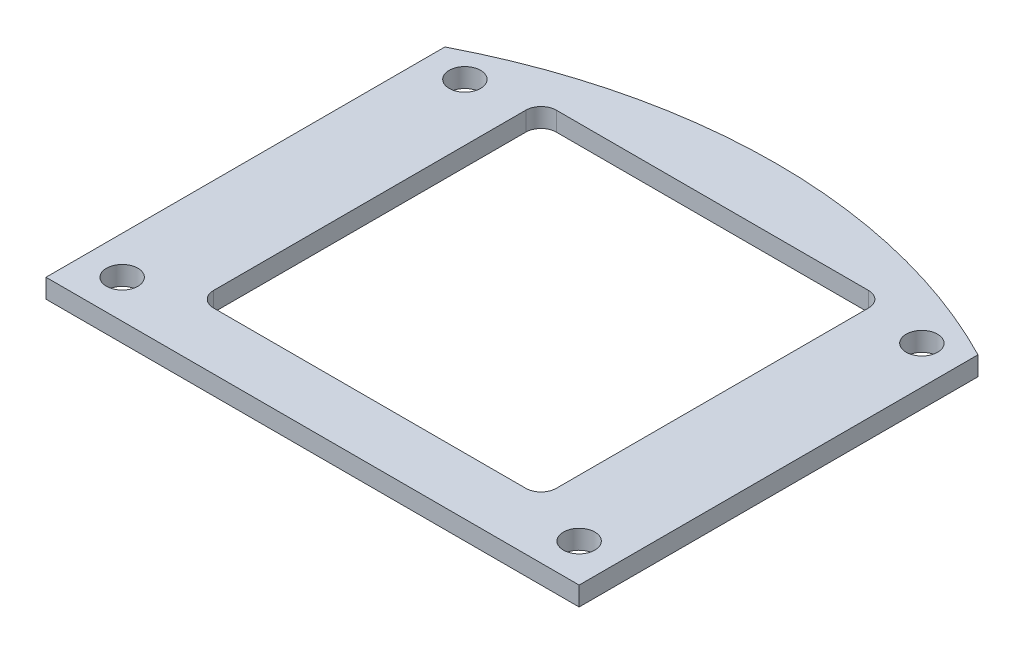
ISO-10303-21;
HEADER;
FILE_DESCRIPTION(('STEP AP214'),'2;1');
FILE_NAME('part.step','',(''),(''),'','','');
FILE_SCHEMA(('AUTOMOTIVE_DESIGN { 1 0 10303 214 1 1 1 1 }'));
ENDSEC;
DATA;
#1=APPLICATION_CONTEXT('core data for automotive mechanical design processes');
#2=APPLICATION_PROTOCOL_DEFINITION('international standard','automotive_design',2000,#1);
#3=PRODUCT_CONTEXT('',#1,'mechanical');
#4=PRODUCT('Part','Part','',(#3));
#5=PRODUCT_RELATED_PRODUCT_CATEGORY('part','',(#4));
#6=PRODUCT_DEFINITION_FORMATION('','',#4);
#7=PRODUCT_DEFINITION_CONTEXT('part definition',#1,'design');
#8=PRODUCT_DEFINITION('design','',#6,#7);
#9=PRODUCT_DEFINITION_SHAPE('','',#8);
#10=(LENGTH_UNIT() NAMED_UNIT(*) SI_UNIT(.MILLI.,.METRE.));
#11=(NAMED_UNIT(*) PLANE_ANGLE_UNIT() SI_UNIT($,.RADIAN.));
#12=(NAMED_UNIT(*) SI_UNIT($,.STERADIAN.) SOLID_ANGLE_UNIT());
#13=UNCERTAINTY_MEASURE_WITH_UNIT(LENGTH_MEASURE(1.E-05),#10,'distance_accuracy_value','');
#14=(GEOMETRIC_REPRESENTATION_CONTEXT(3) GLOBAL_UNCERTAINTY_ASSIGNED_CONTEXT((#13)) GLOBAL_UNIT_ASSIGNED_CONTEXT((#10,
#11,#12)) REPRESENTATION_CONTEXT('',''));
#15=CARTESIAN_POINT('',(0.,0.,0.));
#16=DIRECTION('',(0.,0.,1.));
#17=DIRECTION('',(1.,0.,0.));
#18=AXIS2_PLACEMENT_3D('',#15,#16,#17);
#19=CARTESIAN_POINT('',(28.,2.,0.));
#20=DIRECTION('',(-1.,0.,0.));
#21=DIRECTION('',(0.,0.,1.));
#22=AXIS2_PLACEMENT_3D('',#19,#20,#21);
#23=PLANE('',#22);
#24=DIRECTION('',(0.,0.,-1.));
#25=VECTOR('',#24,1.);
#26=CARTESIAN_POINT('',(28.,0.,0.));
#27=LINE('',#26,#25);
#28=CARTESIAN_POINT('',(28.,0.,24.));
#29=VERTEX_POINT('',#28);
#30=CARTESIAN_POINT('',(28.,0.,-17.8957039195818));
#31=VERTEX_POINT('',#30);
#32=EDGE_CURVE('E154',#29,#31,#27,.T.);
#33=ORIENTED_EDGE('',*,*,#32,.T.);
#34=DIRECTION('',(0.,-1.,0.));
#35=VECTOR('',#34,1.);
#36=CARTESIAN_POINT('',(28.,2.,-17.8957039195818));
#37=LINE('',#36,#35);
#38=CARTESIAN_POINT('',(28.,2.,-17.8957039195818));
#39=VERTEX_POINT('',#38);
#40=EDGE_CURVE('E135',#39,#31,#37,.T.);
#41=ORIENTED_EDGE('',*,*,#40,.F.);
#42=DIRECTION('',(0.,0.,-1.));
#43=VECTOR('',#42,1.);
#44=CARTESIAN_POINT('',(28.,2.,0.));
#45=LINE('',#44,#43);
#46=CARTESIAN_POINT('',(28.,2.,24.));
#47=VERTEX_POINT('',#46);
#48=EDGE_CURVE('E142',#47,#39,#45,.T.);
#49=ORIENTED_EDGE('',*,*,#48,.F.);
#50=DIRECTION('',(0.,-1.,0.));
#51=VECTOR('',#50,1.);
#52=CARTESIAN_POINT('',(28.,2.,24.));
#53=LINE('',#52,#51);
#54=EDGE_CURVE('E230',#47,#29,#53,.T.);
#55=ORIENTED_EDGE('',*,*,#54,.T.);
#56=EDGE_LOOP('',(#33,#41,#49,#55));
#57=FACE_BOUND('',#56,.T.);
#58=ADVANCED_FACE('F41',(#57),#23,.F.);
#59=CARTESIAN_POINT('',(0.,2.,36.3));
#60=DIRECTION('',(0.,-1.,0.));
#61=DIRECTION('',(0.,0.,-1.));
#62=AXIS2_PLACEMENT_3D('',#59,#60,#61);
#63=CYLINDRICAL_SURFACE('',#62,61.0014288630928);
#64=CARTESIAN_POINT('',(0.,0.,36.3));
#65=DIRECTION('',(0.,1.,0.));
#66=DIRECTION('',(0.,0.,1.));
#67=AXIS2_PLACEMENT_3D('',#64,#65,#66);
#68=CIRCLE('',#67,61.0014288630928);
#69=CARTESIAN_POINT('',(-28.,0.,-17.8957039195818));
#70=VERTEX_POINT('',#69);
#71=EDGE_CURVE('E249',#31,#70,#68,.T.);
#72=ORIENTED_EDGE('',*,*,#71,.T.);
#73=DIRECTION('',(0.,-1.,0.));
#74=VECTOR('',#73,1.);
#75=CARTESIAN_POINT('',(-28.,2.,-17.8957039195818));
#76=LINE('',#75,#74);
#77=CARTESIAN_POINT('',(-28.,2.,-17.8957039195818));
#78=VERTEX_POINT('',#77);
#79=EDGE_CURVE('E137',#78,#70,#76,.T.);
#80=ORIENTED_EDGE('',*,*,#79,.F.);
#81=CARTESIAN_POINT('',(0.,2.,36.3));
#82=DIRECTION('',(0.,1.,0.));
#83=DIRECTION('',(0.,0.,1.));
#84=AXIS2_PLACEMENT_3D('',#81,#82,#83);
#85=CIRCLE('',#84,61.0014288630928);
#86=EDGE_CURVE('E130',#39,#78,#85,.T.);
#87=ORIENTED_EDGE('',*,*,#86,.F.);
#88=ORIENTED_EDGE('',*,*,#40,.T.);
#89=EDGE_LOOP('',(#72,#80,#87,#88));
#90=FACE_BOUND('',#89,.T.);
#91=ADVANCED_FACE('F133',(#90),#63,.T.);
#92=CARTESIAN_POINT('',(-28.,2.,0.));
#93=DIRECTION('',(-1.,0.,0.));
#94=DIRECTION('',(0.,0.,1.));
#95=AXIS2_PLACEMENT_3D('',#92,#93,#94);
#96=PLANE('',#95);
#97=DIRECTION('',(0.,0.,-1.));
#98=VECTOR('',#97,1.);
#99=CARTESIAN_POINT('',(-28.,0.,0.));
#100=LINE('',#99,#98);
#101=CARTESIAN_POINT('',(-28.,0.,24.));
#102=VERTEX_POINT('',#101);
#103=EDGE_CURVE('E251',#102,#70,#100,.T.);
#104=ORIENTED_EDGE('',*,*,#103,.F.);
#105=DIRECTION('',(0.,-1.,0.));
#106=VECTOR('',#105,1.);
#107=CARTESIAN_POINT('',(-28.,2.,24.));
#108=LINE('',#107,#106);
#109=CARTESIAN_POINT('',(-28.,2.,24.));
#110=VERTEX_POINT('',#109);
#111=EDGE_CURVE('E159',#110,#102,#108,.T.);
#112=ORIENTED_EDGE('',*,*,#111,.F.);
#113=DIRECTION('',(0.,0.,-1.));
#114=VECTOR('',#113,1.);
#115=CARTESIAN_POINT('',(-28.,2.,0.));
#116=LINE('',#115,#114);
#117=EDGE_CURVE('E141',#110,#78,#116,.T.);
#118=ORIENTED_EDGE('',*,*,#117,.T.);
#119=ORIENTED_EDGE('',*,*,#79,.T.);
#120=EDGE_LOOP('',(#104,#112,#118,#119));
#121=FACE_BOUND('',#120,.T.);
#122=ADVANCED_FACE('F263',(#121),#96,.T.);
#123=CARTESIAN_POINT('',(18.,2.,0.));
#124=DIRECTION('',(-1.,0.,0.));
#125=DIRECTION('',(0.,0.,1.));
#126=AXIS2_PLACEMENT_3D('',#123,#124,#125);
#127=PLANE('',#126);
#128=DIRECTION('',(0.,0.,-1.));
#129=VECTOR('',#128,1.);
#130=CARTESIAN_POINT('',(18.,0.,0.));
#131=LINE('',#130,#129);
#132=CARTESIAN_POINT('',(18.,0.,16.4));
#133=VERTEX_POINT('',#132);
#134=CARTESIAN_POINT('',(18.,0.,-16.4));
#135=VERTEX_POINT('',#134);
#136=EDGE_CURVE('E231',#133,#135,#131,.T.);
#137=ORIENTED_EDGE('',*,*,#136,.F.);
#138=DIRECTION('',(0.,-1.,0.));
#139=VECTOR('',#138,1.);
#140=CARTESIAN_POINT('',(18.,2.,16.4));
#141=LINE('',#140,#139);
#142=CARTESIAN_POINT('',(18.,2.,16.4));
#143=VERTEX_POINT('',#142);
#144=EDGE_CURVE('E173',#133,#143,#141,.F.);
#145=ORIENTED_EDGE('',*,*,#144,.T.);
#146=DIRECTION('',(0.,0.,-1.));
#147=VECTOR('',#146,1.);
#148=CARTESIAN_POINT('',(18.,2.,0.));
#149=LINE('',#148,#147);
#150=CARTESIAN_POINT('',(18.,2.,-16.4));
#151=VERTEX_POINT('',#150);
#152=EDGE_CURVE('E256',#143,#151,#149,.T.);
#153=ORIENTED_EDGE('',*,*,#152,.T.);
#154=DIRECTION('',(0.,-1.,0.));
#155=VECTOR('',#154,1.);
#156=CARTESIAN_POINT('',(18.,2.,-16.4));
#157=LINE('',#156,#155);
#158=EDGE_CURVE('E170',#151,#135,#157,.T.);
#159=ORIENTED_EDGE('',*,*,#158,.T.);
#160=EDGE_LOOP('',(#137,#145,#153,#159));
#161=FACE_BOUND('',#160,.T.);
#162=ADVANCED_FACE('F265',(#161),#127,.T.);
#163=CARTESIAN_POINT('',(0.,2.,18.));
#164=DIRECTION('',(0.,0.,-1.));
#165=DIRECTION('',(-1.,0.,0.));
#166=AXIS2_PLACEMENT_3D('',#163,#164,#165);
#167=PLANE('',#166);
#168=DIRECTION('',(1.,0.,0.));
#169=VECTOR('',#168,1.);
#170=CARTESIAN_POINT('',(0.,0.,18.));
#171=LINE('',#170,#169);
#172=CARTESIAN_POINT('',(-16.4,0.,18.));
#173=VERTEX_POINT('',#172);
#174=CARTESIAN_POINT('',(16.4,0.,18.));
#175=VERTEX_POINT('',#174);
#176=EDGE_CURVE('E206',#173,#175,#171,.T.);
#177=ORIENTED_EDGE('',*,*,#176,.F.);
#178=DIRECTION('',(0.,-1.,0.));
#179=VECTOR('',#178,1.);
#180=CARTESIAN_POINT('',(-16.4,2.,18.));
#181=LINE('',#180,#179);
#182=CARTESIAN_POINT('',(-16.4,2.,18.));
#183=VERTEX_POINT('',#182);
#184=EDGE_CURVE('E168',#173,#183,#181,.F.);
#185=ORIENTED_EDGE('',*,*,#184,.T.);
#186=DIRECTION('',(1.,0.,0.));
#187=VECTOR('',#186,1.);
#188=CARTESIAN_POINT('',(0.,2.,18.));
#189=LINE('',#188,#187);
#190=CARTESIAN_POINT('',(16.4,2.,18.));
#191=VERTEX_POINT('',#190);
#192=EDGE_CURVE('E217',#183,#191,#189,.T.);
#193=ORIENTED_EDGE('',*,*,#192,.T.);
#194=DIRECTION('',(0.,-1.,0.));
#195=VECTOR('',#194,1.);
#196=CARTESIAN_POINT('',(16.4,0.,18.));
#197=LINE('',#196,#195);
#198=EDGE_CURVE('E165',#191,#175,#197,.T.);
#199=ORIENTED_EDGE('',*,*,#198,.T.);
#200=EDGE_LOOP('',(#177,#185,#193,#199));
#201=FACE_BOUND('',#200,.T.);
#202=ADVANCED_FACE('F272',(#201),#167,.T.);
#203=CARTESIAN_POINT('',(-18.,2.,0.));
#204=DIRECTION('',(-1.,0.,0.));
#205=DIRECTION('',(0.,0.,1.));
#206=AXIS2_PLACEMENT_3D('',#203,#204,#205);
#207=PLANE('',#206);
#208=DIRECTION('',(0.,0.,-1.));
#209=VECTOR('',#208,1.);
#210=CARTESIAN_POINT('',(-18.,2.,0.));
#211=LINE('',#210,#209);
#212=CARTESIAN_POINT('',(-18.,2.,16.4));
#213=VERTEX_POINT('',#212);
#214=CARTESIAN_POINT('',(-18.,2.,-16.4));
#215=VERTEX_POINT('',#214);
#216=EDGE_CURVE('E212',#213,#215,#211,.T.);
#217=ORIENTED_EDGE('',*,*,#216,.F.);
#218=DIRECTION('',(0.,-1.,0.));
#219=VECTOR('',#218,1.);
#220=CARTESIAN_POINT('',(-18.,2.,16.4));
#221=LINE('',#220,#219);
#222=CARTESIAN_POINT('',(-18.,0.,16.4));
#223=VERTEX_POINT('',#222);
#224=EDGE_CURVE('E157',#213,#223,#221,.T.);
#225=ORIENTED_EDGE('',*,*,#224,.T.);
#226=DIRECTION('',(0.,0.,-1.));
#227=VECTOR('',#226,1.);
#228=CARTESIAN_POINT('',(-18.,0.,0.));
#229=LINE('',#228,#227);
#230=CARTESIAN_POINT('',(-18.,0.,-16.4));
#231=VERTEX_POINT('',#230);
#232=EDGE_CURVE('E197',#223,#231,#229,.T.);
#233=ORIENTED_EDGE('',*,*,#232,.T.);
#234=DIRECTION('',(0.,-1.,0.));
#235=VECTOR('',#234,1.);
#236=CARTESIAN_POINT('',(-18.,2.,-16.4));
#237=LINE('',#236,#235);
#238=EDGE_CURVE('E155',#231,#215,#237,.F.);
#239=ORIENTED_EDGE('',*,*,#238,.T.);
#240=EDGE_LOOP('',(#217,#225,#233,#239));
#241=FACE_BOUND('',#240,.T.);
#242=ADVANCED_FACE('F204',(#241),#207,.F.);
#243=CARTESIAN_POINT('',(24.,2.,20.));
#244=DIRECTION('',(0.,-1.,0.));
#245=DIRECTION('',(0.,0.,-1.));
#246=AXIS2_PLACEMENT_3D('',#243,#244,#245);
#247=CYLINDRICAL_SURFACE('',#246,1.65);
#248=CARTESIAN_POINT('',(24.,2.,20.));
#249=DIRECTION('',(0.,1.,0.));
#250=DIRECTION('',(0.,0.,1.));
#251=AXIS2_PLACEMENT_3D('',#248,#249,#250);
#252=CIRCLE('',#251,1.65);
#253=CARTESIAN_POINT('',(24.,2.,21.65));
#254=VERTEX_POINT('',#253);
#255=EDGE_CURVE('E151',#254,#254,#252,.T.);
#256=ORIENTED_EDGE('',*,*,#255,.T.);
#257=EDGE_LOOP('',(#256));
#258=FACE_BOUND('',#257,.T.);
#259=CARTESIAN_POINT('',(24.,0.,20.));
#260=DIRECTION('',(0.,1.,0.));
#261=DIRECTION('',(0.,0.,1.));
#262=AXIS2_PLACEMENT_3D('',#259,#260,#261);
#263=CIRCLE('',#262,1.65);
#264=CARTESIAN_POINT('',(24.,0.,21.65));
#265=VERTEX_POINT('',#264);
#266=EDGE_CURVE('E245',#265,#265,#263,.T.);
#267=ORIENTED_EDGE('',*,*,#266,.F.);
#268=EDGE_LOOP('',(#267));
#269=FACE_BOUND('',#268,.T.);
#270=ADVANCED_FACE('F282',(#258,#269),#247,.F.);
#271=CARTESIAN_POINT('',(24.,2.,-16.));
#272=DIRECTION('',(0.,-1.,0.));
#273=DIRECTION('',(0.,0.,-1.));
#274=AXIS2_PLACEMENT_3D('',#271,#272,#273);
#275=CYLINDRICAL_SURFACE('',#274,1.65);
#276=CARTESIAN_POINT('',(24.,2.,-16.));
#277=DIRECTION('',(0.,1.,0.));
#278=DIRECTION('',(0.,0.,1.));
#279=AXIS2_PLACEMENT_3D('',#276,#277,#278);
#280=CIRCLE('',#279,1.65);
#281=CARTESIAN_POINT('',(24.,2.,-14.35));
#282=VERTEX_POINT('',#281);
#283=EDGE_CURVE('E223',#282,#282,#280,.T.);
#284=ORIENTED_EDGE('',*,*,#283,.T.);
#285=EDGE_LOOP('',(#284));
#286=FACE_BOUND('',#285,.T.);
#287=CARTESIAN_POINT('',(24.,0.,-16.));
#288=DIRECTION('',(0.,1.,0.));
#289=DIRECTION('',(0.,0.,1.));
#290=AXIS2_PLACEMENT_3D('',#287,#288,#289);
#291=CIRCLE('',#290,1.65);
#292=CARTESIAN_POINT('',(24.,0.,-14.35));
#293=VERTEX_POINT('',#292);
#294=EDGE_CURVE('E242',#293,#293,#291,.T.);
#295=ORIENTED_EDGE('',*,*,#294,.F.);
#296=EDGE_LOOP('',(#295));
#297=FACE_BOUND('',#296,.T.);
#298=ADVANCED_FACE('F284',(#286,#297),#275,.F.);
#299=CARTESIAN_POINT('',(-24.,2.,20.));
#300=DIRECTION('',(0.,-1.,0.));
#301=DIRECTION('',(0.,0.,-1.));
#302=AXIS2_PLACEMENT_3D('',#299,#300,#301);
#303=CYLINDRICAL_SURFACE('',#302,1.65);
#304=CARTESIAN_POINT('',(-24.,2.,20.));
#305=DIRECTION('',(0.,1.,0.));
#306=DIRECTION('',(0.,0.,1.));
#307=AXIS2_PLACEMENT_3D('',#304,#305,#306);
#308=CIRCLE('',#307,1.65);
#309=CARTESIAN_POINT('',(-24.,2.,21.65));
#310=VERTEX_POINT('',#309);
#311=EDGE_CURVE('E215',#310,#310,#308,.T.);
#312=ORIENTED_EDGE('',*,*,#311,.T.);
#313=EDGE_LOOP('',(#312));
#314=FACE_BOUND('',#313,.T.);
#315=CARTESIAN_POINT('',(-24.,0.,20.));
#316=DIRECTION('',(0.,1.,0.));
#317=DIRECTION('',(0.,0.,1.));
#318=AXIS2_PLACEMENT_3D('',#315,#316,#317);
#319=CIRCLE('',#318,1.65);
#320=CARTESIAN_POINT('',(-24.,0.,21.65));
#321=VERTEX_POINT('',#320);
#322=EDGE_CURVE('E239',#321,#321,#319,.T.);
#323=ORIENTED_EDGE('',*,*,#322,.F.);
#324=EDGE_LOOP('',(#323));
#325=FACE_BOUND('',#324,.T.);
#326=ADVANCED_FACE('F288',(#314,#325),#303,.F.);
#327=CARTESIAN_POINT('',(-24.,2.,-16.));
#328=DIRECTION('',(0.,-1.,0.));
#329=DIRECTION('',(0.,0.,-1.));
#330=AXIS2_PLACEMENT_3D('',#327,#328,#329);
#331=CYLINDRICAL_SURFACE('',#330,1.65);
#332=CARTESIAN_POINT('',(-24.,2.,-16.));
#333=DIRECTION('',(0.,1.,0.));
#334=DIRECTION('',(0.,0.,1.));
#335=AXIS2_PLACEMENT_3D('',#332,#333,#334);
#336=CIRCLE('',#335,1.65);
#337=CARTESIAN_POINT('',(-24.,2.,-14.35));
#338=VERTEX_POINT('',#337);
#339=EDGE_CURVE('E211',#338,#338,#336,.T.);
#340=ORIENTED_EDGE('',*,*,#339,.T.);
#341=EDGE_LOOP('',(#340));
#342=FACE_BOUND('',#341,.T.);
#343=CARTESIAN_POINT('',(-24.,0.,-16.));
#344=DIRECTION('',(0.,1.,0.));
#345=DIRECTION('',(0.,0.,1.));
#346=AXIS2_PLACEMENT_3D('',#343,#344,#345);
#347=CIRCLE('',#346,1.65);
#348=CARTESIAN_POINT('',(-24.,0.,-14.35));
#349=VERTEX_POINT('',#348);
#350=EDGE_CURVE('E236',#349,#349,#347,.T.);
#351=ORIENTED_EDGE('',*,*,#350,.F.);
#352=EDGE_LOOP('',(#351));
#353=FACE_BOUND('',#352,.T.);
#354=ADVANCED_FACE('F292',(#342,#353),#331,.F.);
#355=CARTESIAN_POINT('',(0.,2.,-18.));
#356=DIRECTION('',(0.,0.,-1.));
#357=DIRECTION('',(-1.,0.,0.));
#358=AXIS2_PLACEMENT_3D('',#355,#356,#357);
#359=PLANE('',#358);
#360=DIRECTION('',(1.,0.,0.));
#361=VECTOR('',#360,1.);
#362=CARTESIAN_POINT('',(0.,0.,-18.));
#363=LINE('',#362,#361);
#364=CARTESIAN_POINT('',(-16.4,0.,-18.));
#365=VERTEX_POINT('',#364);
#366=CARTESIAN_POINT('',(16.4,0.,-18.));
#367=VERTEX_POINT('',#366);
#368=EDGE_CURVE('E198',#365,#367,#363,.T.);
#369=ORIENTED_EDGE('',*,*,#368,.T.);
#370=DIRECTION('',(0.,-1.,0.));
#371=VECTOR('',#370,1.);
#372=CARTESIAN_POINT('',(16.4,2.,-18.));
#373=LINE('',#372,#371);
#374=CARTESIAN_POINT('',(16.4,2.,-18.));
#375=VERTEX_POINT('',#374);
#376=EDGE_CURVE('E56',#367,#375,#373,.F.);
#377=ORIENTED_EDGE('',*,*,#376,.T.);
#378=DIRECTION('',(1.,0.,0.));
#379=VECTOR('',#378,1.);
#380=CARTESIAN_POINT('',(0.,2.,-18.));
#381=LINE('',#380,#379);
#382=CARTESIAN_POINT('',(-16.4,2.,-18.));
#383=VERTEX_POINT('',#382);
#384=EDGE_CURVE('E209',#383,#375,#381,.T.);
#385=ORIENTED_EDGE('',*,*,#384,.F.);
#386=DIRECTION('',(0.,-1.,0.));
#387=VECTOR('',#386,1.);
#388=CARTESIAN_POINT('',(-16.4,0.,-18.));
#389=LINE('',#388,#387);
#390=EDGE_CURVE('E175',#383,#365,#389,.T.);
#391=ORIENTED_EDGE('',*,*,#390,.T.);
#392=EDGE_LOOP('',(#369,#377,#385,#391));
#393=FACE_BOUND('',#392,.T.);
#394=ADVANCED_FACE('F208',(#393),#359,.F.);
#395=CARTESIAN_POINT('',(0.,2.,24.));
#396=DIRECTION('',(0.,0.,-1.));
#397=DIRECTION('',(-1.,0.,0.));
#398=AXIS2_PLACEMENT_3D('',#395,#396,#397);
#399=PLANE('',#398);
#400=DIRECTION('',(1.,0.,0.));
#401=VECTOR('',#400,1.);
#402=CARTESIAN_POINT('',(0.,0.,24.));
#403=LINE('',#402,#401);
#404=EDGE_CURVE('E254',#102,#29,#403,.T.);
#405=ORIENTED_EDGE('',*,*,#404,.T.);
#406=ORIENTED_EDGE('',*,*,#54,.F.);
#407=DIRECTION('',(1.,0.,0.));
#408=VECTOR('',#407,1.);
#409=CARTESIAN_POINT('',(0.,2.,24.));
#410=LINE('',#409,#408);
#411=EDGE_CURVE('E147',#110,#47,#410,.T.);
#412=ORIENTED_EDGE('',*,*,#411,.F.);
#413=ORIENTED_EDGE('',*,*,#111,.T.);
#414=EDGE_LOOP('',(#405,#406,#412,#413));
#415=FACE_BOUND('',#414,.T.);
#416=ADVANCED_FACE('F259',(#415),#399,.F.);
#417=CARTESIAN_POINT('',(0.,2.,0.));
#418=DIRECTION('',(0.,1.,0.));
#419=DIRECTION('',(0.,0.,1.));
#420=AXIS2_PLACEMENT_3D('',#417,#418,#419);
#421=PLANE('',#420);
#422=ORIENTED_EDGE('',*,*,#152,.F.);
#423=CARTESIAN_POINT('',(16.4,2.,16.4));
#424=DIRECTION('',(0.,1.,0.));
#425=DIRECTION('',(0.,0.,1.));
#426=AXIS2_PLACEMENT_3D('',#423,#424,#425);
#427=CIRCLE('',#426,1.6);
#428=EDGE_CURVE('E185',#143,#191,#427,.F.);
#429=ORIENTED_EDGE('',*,*,#428,.T.);
#430=ORIENTED_EDGE('',*,*,#192,.F.);
#431=CARTESIAN_POINT('',(-16.4,2.,16.4));
#432=DIRECTION('',(0.,1.,0.));
#433=DIRECTION('',(0.,0.,1.));
#434=AXIS2_PLACEMENT_3D('',#431,#432,#433);
#435=CIRCLE('',#434,1.6);
#436=EDGE_CURVE('E181',#183,#213,#435,.F.);
#437=ORIENTED_EDGE('',*,*,#436,.T.);
#438=ORIENTED_EDGE('',*,*,#216,.T.);
#439=CARTESIAN_POINT('',(-16.4,2.,-16.4));
#440=DIRECTION('',(0.,1.,0.));
#441=DIRECTION('',(0.,0.,1.));
#442=AXIS2_PLACEMENT_3D('',#439,#440,#441);
#443=CIRCLE('',#442,1.6);
#444=EDGE_CURVE('E11',#215,#383,#443,.F.);
#445=ORIENTED_EDGE('',*,*,#444,.T.);
#446=ORIENTED_EDGE('',*,*,#384,.T.);
#447=CARTESIAN_POINT('',(16.4,2.,-16.4));
#448=DIRECTION('',(0.,1.,0.));
#449=DIRECTION('',(0.,0.,1.));
#450=AXIS2_PLACEMENT_3D('',#447,#448,#449);
#451=CIRCLE('',#450,1.6);
#452=EDGE_CURVE('E189',#375,#151,#451,.F.);
#453=ORIENTED_EDGE('',*,*,#452,.T.);
#454=EDGE_LOOP('',(#422,#429,#430,#437,#438,#445,#446,#453));
#455=FACE_BOUND('',#454,.T.);
#456=ORIENTED_EDGE('',*,*,#339,.F.);
#457=EDGE_LOOP('',(#456));
#458=FACE_BOUND('',#457,.T.);
#459=ORIENTED_EDGE('',*,*,#311,.F.);
#460=EDGE_LOOP('',(#459));
#461=FACE_BOUND('',#460,.T.);
#462=ORIENTED_EDGE('',*,*,#283,.F.);
#463=EDGE_LOOP('',(#462));
#464=FACE_BOUND('',#463,.T.);
#465=ORIENTED_EDGE('',*,*,#255,.F.);
#466=EDGE_LOOP('',(#465));
#467=FACE_BOUND('',#466,.T.);
#468=ORIENTED_EDGE('',*,*,#48,.T.);
#469=ORIENTED_EDGE('',*,*,#86,.T.);
#470=ORIENTED_EDGE('',*,*,#117,.F.);
#471=ORIENTED_EDGE('',*,*,#411,.T.);
#472=EDGE_LOOP('',(#468,#469,#470,#471));
#473=FACE_BOUND('',#472,.T.);
#474=ADVANCED_FACE('F145',(#455,#458,#461,#464,#467,#473),#421,.T.);
#475=CARTESIAN_POINT('',(0.,0.,0.));
#476=DIRECTION('',(0.,1.,0.));
#477=DIRECTION('',(0.,0.,1.));
#478=AXIS2_PLACEMENT_3D('',#475,#476,#477);
#479=PLANE('',#478);
#480=ORIENTED_EDGE('',*,*,#176,.T.);
#481=CARTESIAN_POINT('',(16.4,0.,16.4));
#482=DIRECTION('',(0.,1.,0.));
#483=DIRECTION('',(0.,0.,1.));
#484=AXIS2_PLACEMENT_3D('',#481,#482,#483);
#485=CIRCLE('',#484,1.6);
#486=EDGE_CURVE('E183',#175,#133,#485,.T.);
#487=ORIENTED_EDGE('',*,*,#486,.T.);
#488=ORIENTED_EDGE('',*,*,#136,.T.);
#489=CARTESIAN_POINT('',(16.4,0.,-16.4));
#490=DIRECTION('',(0.,1.,0.));
#491=DIRECTION('',(0.,0.,1.));
#492=AXIS2_PLACEMENT_3D('',#489,#490,#491);
#493=CIRCLE('',#492,1.6);
#494=EDGE_CURVE('E187',#135,#367,#493,.T.);
#495=ORIENTED_EDGE('',*,*,#494,.T.);
#496=ORIENTED_EDGE('',*,*,#368,.F.);
#497=CARTESIAN_POINT('',(-16.4,0.,-16.4));
#498=DIRECTION('',(0.,1.,0.));
#499=DIRECTION('',(0.,0.,1.));
#500=AXIS2_PLACEMENT_3D('',#497,#498,#499);
#501=CIRCLE('',#500,1.6);
#502=EDGE_CURVE('E49',#365,#231,#501,.T.);
#503=ORIENTED_EDGE('',*,*,#502,.T.);
#504=ORIENTED_EDGE('',*,*,#232,.F.);
#505=CARTESIAN_POINT('',(-16.4,0.,16.4));
#506=DIRECTION('',(0.,1.,0.));
#507=DIRECTION('',(0.,0.,1.));
#508=AXIS2_PLACEMENT_3D('',#505,#506,#507);
#509=CIRCLE('',#508,1.6);
#510=EDGE_CURVE('E179',#223,#173,#509,.T.);
#511=ORIENTED_EDGE('',*,*,#510,.T.);
#512=EDGE_LOOP('',(#480,#487,#488,#495,#496,#503,#504,#511));
#513=FACE_BOUND('',#512,.T.);
#514=ORIENTED_EDGE('',*,*,#350,.T.);
#515=EDGE_LOOP('',(#514));
#516=FACE_BOUND('',#515,.T.);
#517=ORIENTED_EDGE('',*,*,#322,.T.);
#518=EDGE_LOOP('',(#517));
#519=FACE_BOUND('',#518,.T.);
#520=ORIENTED_EDGE('',*,*,#294,.T.);
#521=EDGE_LOOP('',(#520));
#522=FACE_BOUND('',#521,.T.);
#523=ORIENTED_EDGE('',*,*,#266,.T.);
#524=EDGE_LOOP('',(#523));
#525=FACE_BOUND('',#524,.T.);
#526=ORIENTED_EDGE('',*,*,#32,.F.);
#527=ORIENTED_EDGE('',*,*,#404,.F.);
#528=ORIENTED_EDGE('',*,*,#103,.T.);
#529=ORIENTED_EDGE('',*,*,#71,.F.);
#530=EDGE_LOOP('',(#526,#527,#528,#529));
#531=FACE_BOUND('',#530,.T.);
#532=ADVANCED_FACE('F195',(#513,#516,#519,#522,#525,#531),#479,.F.);
#533=CARTESIAN_POINT('',(-16.4,2.,16.4));
#534=DIRECTION('',(0.,-1.,0.));
#535=DIRECTION('',(0.,0.,-1.));
#536=AXIS2_PLACEMENT_3D('',#533,#534,#535);
#537=CYLINDRICAL_SURFACE('',#536,1.6);
#538=ORIENTED_EDGE('',*,*,#436,.F.);
#539=ORIENTED_EDGE('',*,*,#184,.F.);
#540=ORIENTED_EDGE('',*,*,#510,.F.);
#541=ORIENTED_EDGE('',*,*,#224,.F.);
#542=EDGE_LOOP('',(#538,#539,#540,#541));
#543=FACE_BOUND('',#542,.T.);
#544=ADVANCED_FACE('F304',(#543),#537,.F.);
#545=CARTESIAN_POINT('',(16.4,2.,16.4));
#546=DIRECTION('',(0.,1.,0.));
#547=DIRECTION('',(0.,0.,1.));
#548=AXIS2_PLACEMENT_3D('',#545,#546,#547);
#549=CYLINDRICAL_SURFACE('',#548,1.6);
#550=ORIENTED_EDGE('',*,*,#428,.F.);
#551=ORIENTED_EDGE('',*,*,#144,.F.);
#552=ORIENTED_EDGE('',*,*,#486,.F.);
#553=ORIENTED_EDGE('',*,*,#198,.F.);
#554=EDGE_LOOP('',(#550,#551,#552,#553));
#555=FACE_BOUND('',#554,.T.);
#556=ADVANCED_FACE('F307',(#555),#549,.F.);
#557=CARTESIAN_POINT('',(16.4,2.,-16.4));
#558=DIRECTION('',(0.,-1.,0.));
#559=DIRECTION('',(0.,0.,-1.));
#560=AXIS2_PLACEMENT_3D('',#557,#558,#559);
#561=CYLINDRICAL_SURFACE('',#560,1.6);
#562=ORIENTED_EDGE('',*,*,#452,.F.);
#563=ORIENTED_EDGE('',*,*,#376,.F.);
#564=ORIENTED_EDGE('',*,*,#494,.F.);
#565=ORIENTED_EDGE('',*,*,#158,.F.);
#566=EDGE_LOOP('',(#562,#563,#564,#565));
#567=FACE_BOUND('',#566,.T.);
#568=ADVANCED_FACE('F310',(#567),#561,.F.);
#569=CARTESIAN_POINT('',(-16.4,2.,-16.4));
#570=DIRECTION('',(0.,1.,0.));
#571=DIRECTION('',(0.,0.,1.));
#572=AXIS2_PLACEMENT_3D('',#569,#570,#571);
#573=CYLINDRICAL_SURFACE('',#572,1.6);
#574=ORIENTED_EDGE('',*,*,#444,.F.);
#575=ORIENTED_EDGE('',*,*,#238,.F.);
#576=ORIENTED_EDGE('',*,*,#502,.F.);
#577=ORIENTED_EDGE('',*,*,#390,.F.);
#578=EDGE_LOOP('',(#574,#575,#576,#577));
#579=FACE_BOUND('',#578,.T.);
#580=ADVANCED_FACE('F43',(#579),#573,.F.);
#581=CLOSED_SHELL('',(#58,#91,#122,#162,#202,#242,#270,#298,#326,#354,#394,#416,#474,#532,#544,
#556,#568,#580));
#582=MANIFOLD_SOLID_BREP('B2',#581);
#583=ADVANCED_BREP_SHAPE_REPRESENTATION('',(#18,#582),#14);
#584=SHAPE_DEFINITION_REPRESENTATION(#9,#583);
ENDSEC;
END-ISO-10303-21;
